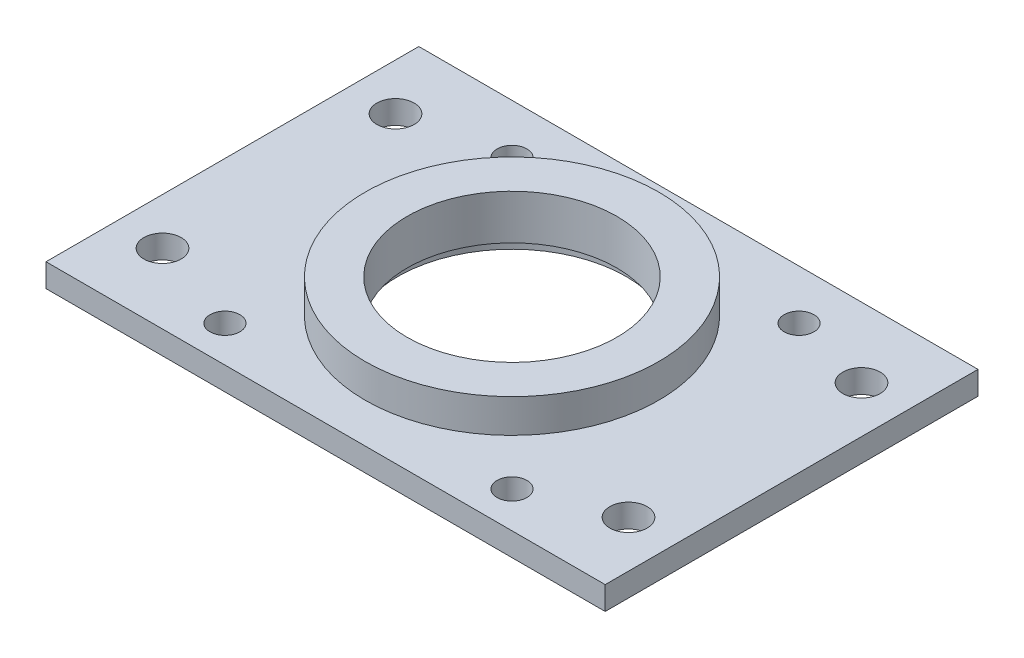
ISO-10303-21;
HEADER;
FILE_DESCRIPTION(('STEP AP214'),'2;1');
FILE_NAME('part.step','',(''),(''),'','','');
FILE_SCHEMA(('AUTOMOTIVE_DESIGN { 1 0 10303 214 1 1 1 1 }'));
ENDSEC;
DATA;
#1=APPLICATION_CONTEXT('core data for automotive mechanical design processes');
#2=APPLICATION_PROTOCOL_DEFINITION('international standard','automotive_design',2000,#1);
#3=PRODUCT_CONTEXT('',#1,'mechanical');
#4=PRODUCT('Part','Part','',(#3));
#5=PRODUCT_RELATED_PRODUCT_CATEGORY('part','',(#4));
#6=PRODUCT_DEFINITION_FORMATION('','',#4);
#7=PRODUCT_DEFINITION_CONTEXT('part definition',#1,'design');
#8=PRODUCT_DEFINITION('design','',#6,#7);
#9=PRODUCT_DEFINITION_SHAPE('','',#8);
#10=(LENGTH_UNIT() NAMED_UNIT(*) SI_UNIT(.MILLI.,.METRE.));
#11=(NAMED_UNIT(*) PLANE_ANGLE_UNIT() SI_UNIT($,.RADIAN.));
#12=(NAMED_UNIT(*) SI_UNIT($,.STERADIAN.) SOLID_ANGLE_UNIT());
#13=UNCERTAINTY_MEASURE_WITH_UNIT(LENGTH_MEASURE(1.E-05),#10,'distance_accuracy_value','');
#14=(GEOMETRIC_REPRESENTATION_CONTEXT(3) GLOBAL_UNCERTAINTY_ASSIGNED_CONTEXT((#13)) GLOBAL_UNIT_ASSIGNED_CONTEXT((#10,
#11,#12)) REPRESENTATION_CONTEXT('',''));
#15=CARTESIAN_POINT('',(0.,0.,0.));
#16=DIRECTION('',(0.,0.,1.));
#17=DIRECTION('',(1.,0.,0.));
#18=AXIS2_PLACEMENT_3D('',#15,#16,#17);
#19=CARTESIAN_POINT('',(0.,4.572,0.));
#20=DIRECTION('',(0.,-1.,0.));
#21=DIRECTION('',(0.,0.,-1.));
#22=AXIS2_PLACEMENT_3D('',#19,#20,#21);
#23=CYLINDRICAL_SURFACE('',#22,14.2875);
#24=CARTESIAN_POINT('',(0.,4.572,0.));
#25=DIRECTION('',(0.,1.,0.));
#26=DIRECTION('',(0.,0.,1.));
#27=AXIS2_PLACEMENT_3D('',#24,#25,#26);
#28=CIRCLE('',#27,14.2875);
#29=CARTESIAN_POINT('',(0.,4.572,14.2875));
#30=VERTEX_POINT('',#29);
#31=EDGE_CURVE('E46',#30,#30,#28,.T.);
#32=ORIENTED_EDGE('',*,*,#31,.T.);
#33=EDGE_LOOP('',(#32));
#34=FACE_BOUND('',#33,.T.);
#35=CARTESIAN_POINT('',(0.,-1.524,0.));
#36=DIRECTION('',(0.,-1.,0.));
#37=DIRECTION('',(0.,0.,-1.));
#38=AXIS2_PLACEMENT_3D('',#35,#36,#37);
#39=CIRCLE('',#38,14.2875);
#40=CARTESIAN_POINT('',(0.,-1.524,-14.2875));
#41=VERTEX_POINT('',#40);
#42=EDGE_CURVE('E40',#41,#41,#39,.T.);
#43=ORIENTED_EDGE('',*,*,#42,.T.);
#44=EDGE_LOOP('',(#43));
#45=FACE_BOUND('',#44,.T.);
#46=ADVANCED_FACE('F36',(#34,#45),#23,.F.);
#47=CARTESIAN_POINT('',(0.,4.572,0.));
#48=DIRECTION('',(0.,1.,0.));
#49=DIRECTION('',(0.,0.,1.));
#50=AXIS2_PLACEMENT_3D('',#47,#48,#49);
#51=PLANE('',#50);
#52=CARTESIAN_POINT('',(0.,4.572,0.));
#53=DIRECTION('',(0.,1.,0.));
#54=DIRECTION('',(0.,0.,1.));
#55=AXIS2_PLACEMENT_3D('',#52,#53,#54);
#56=CIRCLE('',#55,20.0025);
#57=CARTESIAN_POINT('',(0.,4.572,20.0025));
#58=VERTEX_POINT('',#57);
#59=EDGE_CURVE('E11',#58,#58,#56,.T.);
#60=ORIENTED_EDGE('',*,*,#59,.T.);
#61=EDGE_LOOP('',(#60));
#62=FACE_BOUND('',#61,.T.);
#63=ORIENTED_EDGE('',*,*,#31,.F.);
#64=EDGE_LOOP('',(#63));
#65=FACE_BOUND('',#64,.T.);
#66=ADVANCED_FACE('F142',(#62,#65),#51,.T.);
#67=CARTESIAN_POINT('',(0.,4.572,0.));
#68=DIRECTION('',(0.,-1.,0.));
#69=DIRECTION('',(0.,0.,-1.));
#70=AXIS2_PLACEMENT_3D('',#67,#68,#69);
#71=CYLINDRICAL_SURFACE('',#70,20.0025);
#72=ORIENTED_EDGE('',*,*,#59,.F.);
#73=EDGE_LOOP('',(#72));
#74=FACE_BOUND('',#73,.T.);
#75=CARTESIAN_POINT('',(0.,0.,0.));
#76=DIRECTION('',(0.,1.,0.));
#77=DIRECTION('',(0.,0.,1.));
#78=AXIS2_PLACEMENT_3D('',#75,#76,#77);
#79=CIRCLE('',#78,20.0025);
#80=CARTESIAN_POINT('',(0.,0.,20.0025));
#81=VERTEX_POINT('',#80);
#82=EDGE_CURVE('E115',#81,#81,#79,.T.);
#83=ORIENTED_EDGE('',*,*,#82,.T.);
#84=EDGE_LOOP('',(#83));
#85=FACE_BOUND('',#84,.T.);
#86=ADVANCED_FACE('F38',(#74,#85),#71,.T.);
#87=CARTESIAN_POINT('',(0.,-3.175,0.));
#88=DIRECTION('',(0.,-1.,0.));
#89=DIRECTION('',(0.,0.,-1.));
#90=AXIS2_PLACEMENT_3D('',#87,#88,#89);
#91=PLANE('',#90);
#92=CARTESIAN_POINT('',(-31.75,-3.175,-15.875));
#93=DIRECTION('',(0.,1.,0.));
#94=DIRECTION('',(0.,0.,1.));
#95=AXIS2_PLACEMENT_3D('',#92,#93,#94);
#96=CIRCLE('',#95,2.54);
#97=CARTESIAN_POINT('',(-31.75,-3.175,-13.335));
#98=VERTEX_POINT('',#97);
#99=EDGE_CURVE('E291',#98,#98,#96,.T.);
#100=ORIENTED_EDGE('',*,*,#99,.T.);
#101=EDGE_LOOP('',(#100));
#102=FACE_BOUND('',#101,.T.);
#103=CARTESIAN_POINT('',(20.4660500000004,-3.175,20.46605));
#104=DIRECTION('',(0.,1.,0.));
#105=DIRECTION('',(0.,0.,1.));
#106=AXIS2_PLACEMENT_3D('',#103,#104,#105);
#107=CIRCLE('',#106,2.032);
#108=CARTESIAN_POINT('',(20.4660500000004,-3.175,22.49805));
#109=VERTEX_POINT('',#108);
#110=EDGE_CURVE('E317',#109,#109,#107,.T.);
#111=ORIENTED_EDGE('',*,*,#110,.T.);
#112=EDGE_LOOP('',(#111));
#113=FACE_BOUND('',#112,.T.);
#114=CARTESIAN_POINT('',(-18.6499499999996,-3.175,20.46605));
#115=DIRECTION('',(0.,1.,0.));
#116=DIRECTION('',(0.,0.,1.));
#117=AXIS2_PLACEMENT_3D('',#114,#115,#116);
#118=CIRCLE('',#117,2.032);
#119=CARTESIAN_POINT('',(-18.6499499999996,-3.175,22.49805));
#120=VERTEX_POINT('',#119);
#121=EDGE_CURVE('E311',#120,#120,#118,.T.);
#122=ORIENTED_EDGE('',*,*,#121,.T.);
#123=EDGE_LOOP('',(#122));
#124=FACE_BOUND('',#123,.T.);
#125=CARTESIAN_POINT('',(20.46605,-3.175,-18.64995));
#126=DIRECTION('',(0.,1.,0.));
#127=DIRECTION('',(0.,0.,1.));
#128=AXIS2_PLACEMENT_3D('',#125,#126,#127);
#129=CIRCLE('',#128,2.032);
#130=CARTESIAN_POINT('',(20.46605,-3.175,-16.61795));
#131=VERTEX_POINT('',#130);
#132=EDGE_CURVE('E304',#131,#131,#129,.T.);
#133=ORIENTED_EDGE('',*,*,#132,.T.);
#134=EDGE_LOOP('',(#133));
#135=FACE_BOUND('',#134,.T.);
#136=CARTESIAN_POINT('',(31.75,-3.175,-15.875));
#137=DIRECTION('',(0.,1.,0.));
#138=DIRECTION('',(0.,0.,1.));
#139=AXIS2_PLACEMENT_3D('',#136,#137,#138);
#140=CIRCLE('',#139,2.54);
#141=CARTESIAN_POINT('',(31.75,-3.175,-13.335));
#142=VERTEX_POINT('',#141);
#143=EDGE_CURVE('E295',#142,#142,#140,.T.);
#144=ORIENTED_EDGE('',*,*,#143,.T.);
#145=EDGE_LOOP('',(#144));
#146=FACE_BOUND('',#145,.T.);
#147=CARTESIAN_POINT('',(31.7500000000003,-3.175,15.875));
#148=DIRECTION('',(0.,1.,0.));
#149=DIRECTION('',(0.,0.,1.));
#150=AXIS2_PLACEMENT_3D('',#147,#148,#149);
#151=CIRCLE('',#150,2.54);
#152=CARTESIAN_POINT('',(31.7500000000003,-3.175,18.415));
#153=VERTEX_POINT('',#152);
#154=EDGE_CURVE('E357',#153,#153,#151,.T.);
#155=ORIENTED_EDGE('',*,*,#154,.T.);
#156=EDGE_LOOP('',(#155));
#157=FACE_BOUND('',#156,.T.);
#158=CARTESIAN_POINT('',(-31.7499999999997,-3.175,15.875));
#159=DIRECTION('',(0.,1.,0.));
#160=DIRECTION('',(0.,0.,1.));
#161=AXIS2_PLACEMENT_3D('',#158,#159,#160);
#162=CIRCLE('',#161,2.54);
#163=CARTESIAN_POINT('',(-31.7499999999997,-3.175,18.415));
#164=VERTEX_POINT('',#163);
#165=EDGE_CURVE('E351',#164,#164,#162,.T.);
#166=ORIENTED_EDGE('',*,*,#165,.T.);
#167=EDGE_LOOP('',(#166));
#168=FACE_BOUND('',#167,.T.);
#169=CARTESIAN_POINT('',(-18.64995,-3.175,-18.64995));
#170=DIRECTION('',(0.,1.,0.));
#171=DIRECTION('',(0.,0.,1.));
#172=AXIS2_PLACEMENT_3D('',#169,#170,#171);
#173=CIRCLE('',#172,2.032);
#174=CARTESIAN_POINT('',(-18.64995,-3.175,-16.61795));
#175=VERTEX_POINT('',#174);
#176=EDGE_CURVE('E318',#175,#175,#173,.T.);
#177=ORIENTED_EDGE('',*,*,#176,.T.);
#178=EDGE_LOOP('',(#177));
#179=FACE_BOUND('',#178,.T.);
#180=CARTESIAN_POINT('',(0.,-3.175,0.));
#181=DIRECTION('',(0.,-1.,0.));
#182=DIRECTION('',(0.,0.,-1.));
#183=AXIS2_PLACEMENT_3D('',#180,#181,#182);
#184=CIRCLE('',#183,15.5575);
#185=CARTESIAN_POINT('',(0.,-3.175,-15.5575));
#186=VERTEX_POINT('',#185);
#187=EDGE_CURVE('E321',#186,#186,#184,.T.);
#188=ORIENTED_EDGE('',*,*,#187,.F.);
#189=EDGE_LOOP('',(#188));
#190=FACE_BOUND('',#189,.T.);
#191=DIRECTION('',(0.,0.,-1.));
#192=VECTOR('',#191,1.);
#193=CARTESIAN_POINT('',(-38.1,-3.175,-25.4));
#194=LINE('',#193,#192);
#195=CARTESIAN_POINT('',(-38.1,-3.175,25.4));
#196=VERTEX_POINT('',#195);
#197=CARTESIAN_POINT('',(-38.1,-3.175,-25.4));
#198=VERTEX_POINT('',#197);
#199=EDGE_CURVE('E91',#196,#198,#194,.T.);
#200=ORIENTED_EDGE('',*,*,#199,.T.);
#201=DIRECTION('',(1.,0.,0.));
#202=VECTOR('',#201,1.);
#203=CARTESIAN_POINT('',(38.1,-3.175,-25.4));
#204=LINE('',#203,#202);
#205=CARTESIAN_POINT('',(38.1,-3.175,-25.4));
#206=VERTEX_POINT('',#205);
#207=EDGE_CURVE('E86',#198,#206,#204,.T.);
#208=ORIENTED_EDGE('',*,*,#207,.T.);
#209=DIRECTION('',(0.,0.,1.));
#210=VECTOR('',#209,1.);
#211=CARTESIAN_POINT('',(38.1,-3.175,-25.4));
#212=LINE('',#211,#210);
#213=CARTESIAN_POINT('',(38.1,-3.175,25.4));
#214=VERTEX_POINT('',#213);
#215=EDGE_CURVE('E89',#206,#214,#212,.T.);
#216=ORIENTED_EDGE('',*,*,#215,.T.);
#217=DIRECTION('',(-1.,0.,0.));
#218=VECTOR('',#217,1.);
#219=CARTESIAN_POINT('',(38.1,-3.175,25.4));
#220=LINE('',#219,#218);
#221=EDGE_CURVE('E55',#214,#196,#220,.T.);
#222=ORIENTED_EDGE('',*,*,#221,.T.);
#223=EDGE_LOOP('',(#200,#208,#216,#222));
#224=FACE_BOUND('',#223,.T.);
#225=ADVANCED_FACE('F87',(#102,#113,#124,#135,#146,#157,#168,#179,#190,#224),#91,.T.);
#226=CARTESIAN_POINT('',(0.,0.,0.));
#227=DIRECTION('',(0.,-1.,0.));
#228=DIRECTION('',(0.,0.,-1.));
#229=AXIS2_PLACEMENT_3D('',#226,#227,#228);
#230=PLANE('',#229);
#231=CARTESIAN_POINT('',(-31.75,0.,-15.875));
#232=DIRECTION('',(0.,1.,0.));
#233=DIRECTION('',(0.,0.,1.));
#234=AXIS2_PLACEMENT_3D('',#231,#232,#233);
#235=CIRCLE('',#234,2.54);
#236=CARTESIAN_POINT('',(-31.75,0.,-13.335));
#237=VERTEX_POINT('',#236);
#238=EDGE_CURVE('E294',#237,#237,#235,.T.);
#239=ORIENTED_EDGE('',*,*,#238,.F.);
#240=EDGE_LOOP('',(#239));
#241=FACE_BOUND('',#240,.T.);
#242=CARTESIAN_POINT('',(20.4660500000004,0.,20.46605));
#243=DIRECTION('',(0.,1.,0.));
#244=DIRECTION('',(0.,0.,1.));
#245=AXIS2_PLACEMENT_3D('',#242,#243,#244);
#246=CIRCLE('',#245,2.032);
#247=CARTESIAN_POINT('',(20.4660500000004,0.,22.49805));
#248=VERTEX_POINT('',#247);
#249=EDGE_CURVE('E297',#248,#248,#246,.T.);
#250=ORIENTED_EDGE('',*,*,#249,.F.);
#251=EDGE_LOOP('',(#250));
#252=FACE_BOUND('',#251,.T.);
#253=CARTESIAN_POINT('',(-18.6499499999996,0.,20.46605));
#254=DIRECTION('',(0.,1.,0.));
#255=DIRECTION('',(0.,0.,1.));
#256=AXIS2_PLACEMENT_3D('',#253,#254,#255);
#257=CIRCLE('',#256,2.032);
#258=CARTESIAN_POINT('',(-18.6499499999996,0.,22.49805));
#259=VERTEX_POINT('',#258);
#260=EDGE_CURVE('E314',#259,#259,#257,.T.);
#261=ORIENTED_EDGE('',*,*,#260,.F.);
#262=EDGE_LOOP('',(#261));
#263=FACE_BOUND('',#262,.T.);
#264=CARTESIAN_POINT('',(20.46605,0.,-18.64995));
#265=DIRECTION('',(0.,1.,0.));
#266=DIRECTION('',(0.,0.,1.));
#267=AXIS2_PLACEMENT_3D('',#264,#265,#266);
#268=CIRCLE('',#267,2.032);
#269=CARTESIAN_POINT('',(20.46605,0.,-16.61795));
#270=VERTEX_POINT('',#269);
#271=EDGE_CURVE('E308',#270,#270,#268,.T.);
#272=ORIENTED_EDGE('',*,*,#271,.F.);
#273=EDGE_LOOP('',(#272));
#274=FACE_BOUND('',#273,.T.);
#275=CARTESIAN_POINT('',(31.75,0.,-15.875));
#276=DIRECTION('',(0.,1.,0.));
#277=DIRECTION('',(0.,0.,1.));
#278=AXIS2_PLACEMENT_3D('',#275,#276,#277);
#279=CIRCLE('',#278,2.54);
#280=CARTESIAN_POINT('',(31.75,0.,-13.335));
#281=VERTEX_POINT('',#280);
#282=EDGE_CURVE('E300',#281,#281,#279,.T.);
#283=ORIENTED_EDGE('',*,*,#282,.F.);
#284=EDGE_LOOP('',(#283));
#285=FACE_BOUND('',#284,.T.);
#286=CARTESIAN_POINT('',(31.7500000000003,0.,15.875));
#287=DIRECTION('',(0.,1.,0.));
#288=DIRECTION('',(0.,0.,1.));
#289=AXIS2_PLACEMENT_3D('',#286,#287,#288);
#290=CIRCLE('',#289,2.54);
#291=CARTESIAN_POINT('',(31.7500000000003,0.,18.415));
#292=VERTEX_POINT('',#291);
#293=EDGE_CURVE('E354',#292,#292,#290,.T.);
#294=ORIENTED_EDGE('',*,*,#293,.F.);
#295=EDGE_LOOP('',(#294));
#296=FACE_BOUND('',#295,.T.);
#297=CARTESIAN_POINT('',(-31.7499999999997,0.,15.875));
#298=DIRECTION('',(0.,1.,0.));
#299=DIRECTION('',(0.,0.,1.));
#300=AXIS2_PLACEMENT_3D('',#297,#298,#299);
#301=CIRCLE('',#300,2.54);
#302=CARTESIAN_POINT('',(-31.7499999999997,0.,18.415));
#303=VERTEX_POINT('',#302);
#304=EDGE_CURVE('E348',#303,#303,#301,.T.);
#305=ORIENTED_EDGE('',*,*,#304,.F.);
#306=EDGE_LOOP('',(#305));
#307=FACE_BOUND('',#306,.T.);
#308=CARTESIAN_POINT('',(-18.64995,0.,-18.64995));
#309=DIRECTION('',(0.,1.,0.));
#310=DIRECTION('',(0.,0.,1.));
#311=AXIS2_PLACEMENT_3D('',#308,#309,#310);
#312=CIRCLE('',#311,2.032);
#313=CARTESIAN_POINT('',(-18.64995,0.,-16.61795));
#314=VERTEX_POINT('',#313);
#315=EDGE_CURVE('E307',#314,#314,#312,.T.);
#316=ORIENTED_EDGE('',*,*,#315,.F.);
#317=EDGE_LOOP('',(#316));
#318=FACE_BOUND('',#317,.T.);
#319=ORIENTED_EDGE('',*,*,#82,.F.);
#320=EDGE_LOOP('',(#319));
#321=FACE_BOUND('',#320,.T.);
#322=DIRECTION('',(0.,0.,-1.));
#323=VECTOR('',#322,1.);
#324=CARTESIAN_POINT('',(-38.1,0.,-25.4));
#325=LINE('',#324,#323);
#326=CARTESIAN_POINT('',(-38.1,0.,25.4));
#327=VERTEX_POINT('',#326);
#328=CARTESIAN_POINT('',(-38.1,0.,-25.4));
#329=VERTEX_POINT('',#328);
#330=EDGE_CURVE('E106',#327,#329,#325,.T.);
#331=ORIENTED_EDGE('',*,*,#330,.F.);
#332=DIRECTION('',(-1.,0.,0.));
#333=VECTOR('',#332,1.);
#334=CARTESIAN_POINT('',(38.1,0.,25.4));
#335=LINE('',#334,#333);
#336=CARTESIAN_POINT('',(38.1,0.,25.4));
#337=VERTEX_POINT('',#336);
#338=EDGE_CURVE('E78',#337,#327,#335,.T.);
#339=ORIENTED_EDGE('',*,*,#338,.F.);
#340=DIRECTION('',(0.,0.,1.));
#341=VECTOR('',#340,1.);
#342=CARTESIAN_POINT('',(38.1,0.,-25.4));
#343=LINE('',#342,#341);
#344=CARTESIAN_POINT('',(38.1,0.,-25.4));
#345=VERTEX_POINT('',#344);
#346=EDGE_CURVE('E72',#345,#337,#343,.T.);
#347=ORIENTED_EDGE('',*,*,#346,.F.);
#348=DIRECTION('',(1.,0.,0.));
#349=VECTOR('',#348,1.);
#350=CARTESIAN_POINT('',(38.1,0.,-25.4));
#351=LINE('',#350,#349);
#352=EDGE_CURVE('E96',#329,#345,#351,.T.);
#353=ORIENTED_EDGE('',*,*,#352,.F.);
#354=EDGE_LOOP('',(#331,#339,#347,#353));
#355=FACE_BOUND('',#354,.T.);
#356=ADVANCED_FACE('F121',(#241,#252,#263,#274,#285,#296,#307,#318,#321,#355),#230,.F.);
#357=CARTESIAN_POINT('',(-38.1,-3.175,-25.4));
#358=DIRECTION('',(1.,0.,0.));
#359=DIRECTION('',(0.,0.,-1.));
#360=AXIS2_PLACEMENT_3D('',#357,#358,#359);
#361=PLANE('',#360);
#362=ORIENTED_EDGE('',*,*,#330,.T.);
#363=DIRECTION('',(0.,1.,0.));
#364=VECTOR('',#363,1.);
#365=CARTESIAN_POINT('',(-38.1,-3.175,-25.4));
#366=LINE('',#365,#364);
#367=EDGE_CURVE('E97',#198,#329,#366,.T.);
#368=ORIENTED_EDGE('',*,*,#367,.F.);
#369=ORIENTED_EDGE('',*,*,#199,.F.);
#370=DIRECTION('',(0.,1.,0.));
#371=VECTOR('',#370,1.);
#372=CARTESIAN_POINT('',(-38.1,-3.175,25.4));
#373=LINE('',#372,#371);
#374=EDGE_CURVE('E102',#196,#327,#373,.T.);
#375=ORIENTED_EDGE('',*,*,#374,.T.);
#376=EDGE_LOOP('',(#362,#368,#369,#375));
#377=FACE_BOUND('',#376,.T.);
#378=ADVANCED_FACE('F124',(#377),#361,.F.);
#379=CARTESIAN_POINT('',(38.1,-3.175,-25.4));
#380=DIRECTION('',(0.,0.,1.));
#381=DIRECTION('',(1.,0.,0.));
#382=AXIS2_PLACEMENT_3D('',#379,#380,#381);
#383=PLANE('',#382);
#384=ORIENTED_EDGE('',*,*,#352,.T.);
#385=DIRECTION('',(0.,1.,0.));
#386=VECTOR('',#385,1.);
#387=CARTESIAN_POINT('',(38.1,-3.175,-25.4));
#388=LINE('',#387,#386);
#389=EDGE_CURVE('E94',#206,#345,#388,.T.);
#390=ORIENTED_EDGE('',*,*,#389,.F.);
#391=ORIENTED_EDGE('',*,*,#207,.F.);
#392=ORIENTED_EDGE('',*,*,#367,.T.);
#393=EDGE_LOOP('',(#384,#390,#391,#392));
#394=FACE_BOUND('',#393,.T.);
#395=ADVANCED_FACE('F95',(#394),#383,.F.);
#396=CARTESIAN_POINT('',(38.1,-3.175,-25.4));
#397=DIRECTION('',(-1.,0.,0.));
#398=DIRECTION('',(0.,0.,1.));
#399=AXIS2_PLACEMENT_3D('',#396,#397,#398);
#400=PLANE('',#399);
#401=ORIENTED_EDGE('',*,*,#346,.T.);
#402=DIRECTION('',(0.,1.,0.));
#403=VECTOR('',#402,1.);
#404=CARTESIAN_POINT('',(38.1,-3.175,25.4));
#405=LINE('',#404,#403);
#406=EDGE_CURVE('E98',#214,#337,#405,.T.);
#407=ORIENTED_EDGE('',*,*,#406,.F.);
#408=ORIENTED_EDGE('',*,*,#215,.F.);
#409=ORIENTED_EDGE('',*,*,#389,.T.);
#410=EDGE_LOOP('',(#401,#407,#408,#409));
#411=FACE_BOUND('',#410,.T.);
#412=ADVANCED_FACE('F100',(#411),#400,.F.);
#413=CARTESIAN_POINT('',(38.1,-3.175,25.4));
#414=DIRECTION('',(0.,0.,-1.));
#415=DIRECTION('',(-1.,0.,0.));
#416=AXIS2_PLACEMENT_3D('',#413,#414,#415);
#417=PLANE('',#416);
#418=ORIENTED_EDGE('',*,*,#338,.T.);
#419=ORIENTED_EDGE('',*,*,#374,.F.);
#420=ORIENTED_EDGE('',*,*,#221,.F.);
#421=ORIENTED_EDGE('',*,*,#406,.T.);
#422=EDGE_LOOP('',(#418,#419,#420,#421));
#423=FACE_BOUND('',#422,.T.);
#424=ADVANCED_FACE('F129',(#423),#417,.F.);
#425=CARTESIAN_POINT('',(0.,-1.524,0.));
#426=DIRECTION('',(0.,-1.,0.));
#427=DIRECTION('',(0.,0.,-1.));
#428=AXIS2_PLACEMENT_3D('',#425,#426,#427);
#429=CYLINDRICAL_SURFACE('',#428,15.5575);
#430=CARTESIAN_POINT('',(0.,-1.524,0.));
#431=DIRECTION('',(0.,-1.,0.));
#432=DIRECTION('',(0.,0.,-1.));
#433=AXIS2_PLACEMENT_3D('',#430,#431,#432);
#434=CIRCLE('',#433,15.5575);
#435=CARTESIAN_POINT('',(0.,-1.524,-15.5575));
#436=VERTEX_POINT('',#435);
#437=EDGE_CURVE('E324',#436,#436,#434,.T.);
#438=ORIENTED_EDGE('',*,*,#437,.F.);
#439=EDGE_LOOP('',(#438));
#440=FACE_BOUND('',#439,.T.);
#441=ORIENTED_EDGE('',*,*,#187,.T.);
#442=EDGE_LOOP('',(#441));
#443=FACE_BOUND('',#442,.T.);
#444=ADVANCED_FACE('F131',(#440,#443),#429,.F.);
#445=CARTESIAN_POINT('',(0.,-1.524,0.));
#446=DIRECTION('',(0.,-1.,0.));
#447=DIRECTION('',(0.,0.,-1.));
#448=AXIS2_PLACEMENT_3D('',#445,#446,#447);
#449=PLANE('',#448);
#450=ORIENTED_EDGE('',*,*,#42,.F.);
#451=EDGE_LOOP('',(#450));
#452=FACE_BOUND('',#451,.T.);
#453=ORIENTED_EDGE('',*,*,#437,.T.);
#454=EDGE_LOOP('',(#453));
#455=FACE_BOUND('',#454,.T.);
#456=ADVANCED_FACE('F137',(#452,#455),#449,.T.);
#457=CARTESIAN_POINT('',(-18.64995,-3.175,-18.64995));
#458=DIRECTION('',(0.,1.,0.));
#459=DIRECTION('',(0.,0.,1.));
#460=AXIS2_PLACEMENT_3D('',#457,#458,#459);
#461=CYLINDRICAL_SURFACE('',#460,2.032);
#462=ORIENTED_EDGE('',*,*,#176,.F.);
#463=EDGE_LOOP('',(#462));
#464=FACE_BOUND('',#463,.T.);
#465=ORIENTED_EDGE('',*,*,#315,.T.);
#466=EDGE_LOOP('',(#465));
#467=FACE_BOUND('',#466,.T.);
#468=ADVANCED_FACE('F186',(#464,#467),#461,.F.);
#469=CARTESIAN_POINT('',(-31.7499999999997,-3.175,15.875));
#470=DIRECTION('',(0.,1.,0.));
#471=DIRECTION('',(0.,0.,1.));
#472=AXIS2_PLACEMENT_3D('',#469,#470,#471);
#473=CYLINDRICAL_SURFACE('',#472,2.54);
#474=ORIENTED_EDGE('',*,*,#165,.F.);
#475=EDGE_LOOP('',(#474));
#476=FACE_BOUND('',#475,.T.);
#477=ORIENTED_EDGE('',*,*,#304,.T.);
#478=EDGE_LOOP('',(#477));
#479=FACE_BOUND('',#478,.T.);
#480=ADVANCED_FACE('F214',(#476,#479),#473,.F.);
#481=CARTESIAN_POINT('',(31.7500000000003,-3.175,15.875));
#482=DIRECTION('',(0.,1.,0.));
#483=DIRECTION('',(0.,0.,1.));
#484=AXIS2_PLACEMENT_3D('',#481,#482,#483);
#485=CYLINDRICAL_SURFACE('',#484,2.54);
#486=ORIENTED_EDGE('',*,*,#154,.F.);
#487=EDGE_LOOP('',(#486));
#488=FACE_BOUND('',#487,.T.);
#489=ORIENTED_EDGE('',*,*,#293,.T.);
#490=EDGE_LOOP('',(#489));
#491=FACE_BOUND('',#490,.T.);
#492=ADVANCED_FACE('F224',(#488,#491),#485,.F.);
#493=CARTESIAN_POINT('',(31.75,-3.175,-15.875));
#494=DIRECTION('',(0.,1.,0.));
#495=DIRECTION('',(0.,0.,1.));
#496=AXIS2_PLACEMENT_3D('',#493,#494,#495);
#497=CYLINDRICAL_SURFACE('',#496,2.54);
#498=ORIENTED_EDGE('',*,*,#143,.F.);
#499=EDGE_LOOP('',(#498));
#500=FACE_BOUND('',#499,.T.);
#501=ORIENTED_EDGE('',*,*,#282,.T.);
#502=EDGE_LOOP('',(#501));
#503=FACE_BOUND('',#502,.T.);
#504=ADVANCED_FACE('F234',(#500,#503),#497,.F.);
#505=CARTESIAN_POINT('',(20.46605,-3.175,-18.64995));
#506=DIRECTION('',(0.,1.,0.));
#507=DIRECTION('',(0.,0.,1.));
#508=AXIS2_PLACEMENT_3D('',#505,#506,#507);
#509=CYLINDRICAL_SURFACE('',#508,2.032);
#510=ORIENTED_EDGE('',*,*,#132,.F.);
#511=EDGE_LOOP('',(#510));
#512=FACE_BOUND('',#511,.T.);
#513=ORIENTED_EDGE('',*,*,#271,.T.);
#514=EDGE_LOOP('',(#513));
#515=FACE_BOUND('',#514,.T.);
#516=ADVANCED_FACE('F244',(#512,#515),#509,.F.);
#517=CARTESIAN_POINT('',(-18.6499499999996,-3.175,20.46605));
#518=DIRECTION('',(0.,1.,0.));
#519=DIRECTION('',(0.,0.,1.));
#520=AXIS2_PLACEMENT_3D('',#517,#518,#519);
#521=CYLINDRICAL_SURFACE('',#520,2.032);
#522=ORIENTED_EDGE('',*,*,#121,.F.);
#523=EDGE_LOOP('',(#522));
#524=FACE_BOUND('',#523,.T.);
#525=ORIENTED_EDGE('',*,*,#260,.T.);
#526=EDGE_LOOP('',(#525));
#527=FACE_BOUND('',#526,.T.);
#528=ADVANCED_FACE('F254',(#524,#527),#521,.F.);
#529=CARTESIAN_POINT('',(20.4660500000004,-3.175,20.46605));
#530=DIRECTION('',(0.,1.,0.));
#531=DIRECTION('',(0.,0.,1.));
#532=AXIS2_PLACEMENT_3D('',#529,#530,#531);
#533=CYLINDRICAL_SURFACE('',#532,2.032);
#534=ORIENTED_EDGE('',*,*,#110,.F.);
#535=EDGE_LOOP('',(#534));
#536=FACE_BOUND('',#535,.T.);
#537=ORIENTED_EDGE('',*,*,#249,.T.);
#538=EDGE_LOOP('',(#537));
#539=FACE_BOUND('',#538,.T.);
#540=ADVANCED_FACE('F264',(#536,#539),#533,.F.);
#541=CARTESIAN_POINT('',(-31.75,-3.175,-15.875));
#542=DIRECTION('',(0.,1.,0.));
#543=DIRECTION('',(0.,0.,1.));
#544=AXIS2_PLACEMENT_3D('',#541,#542,#543);
#545=CYLINDRICAL_SURFACE('',#544,2.54);
#546=ORIENTED_EDGE('',*,*,#99,.F.);
#547=EDGE_LOOP('',(#546));
#548=FACE_BOUND('',#547,.T.);
#549=ORIENTED_EDGE('',*,*,#238,.T.);
#550=EDGE_LOOP('',(#549));
#551=FACE_BOUND('',#550,.T.);
#552=ADVANCED_FACE('F274',(#548,#551),#545,.F.);
#553=CLOSED_SHELL('',(#46,#66,#86,#225,#356,#378,#395,#412,#424,#444,#456,#468,#480,#492,#504,
#516,#528,#540,#552));
#554=MANIFOLD_SOLID_BREP('B2',#553);
#555=ADVANCED_BREP_SHAPE_REPRESENTATION('',(#18,#554),#14);
#556=SHAPE_DEFINITION_REPRESENTATION(#9,#555);
ENDSEC;
END-ISO-10303-21;
